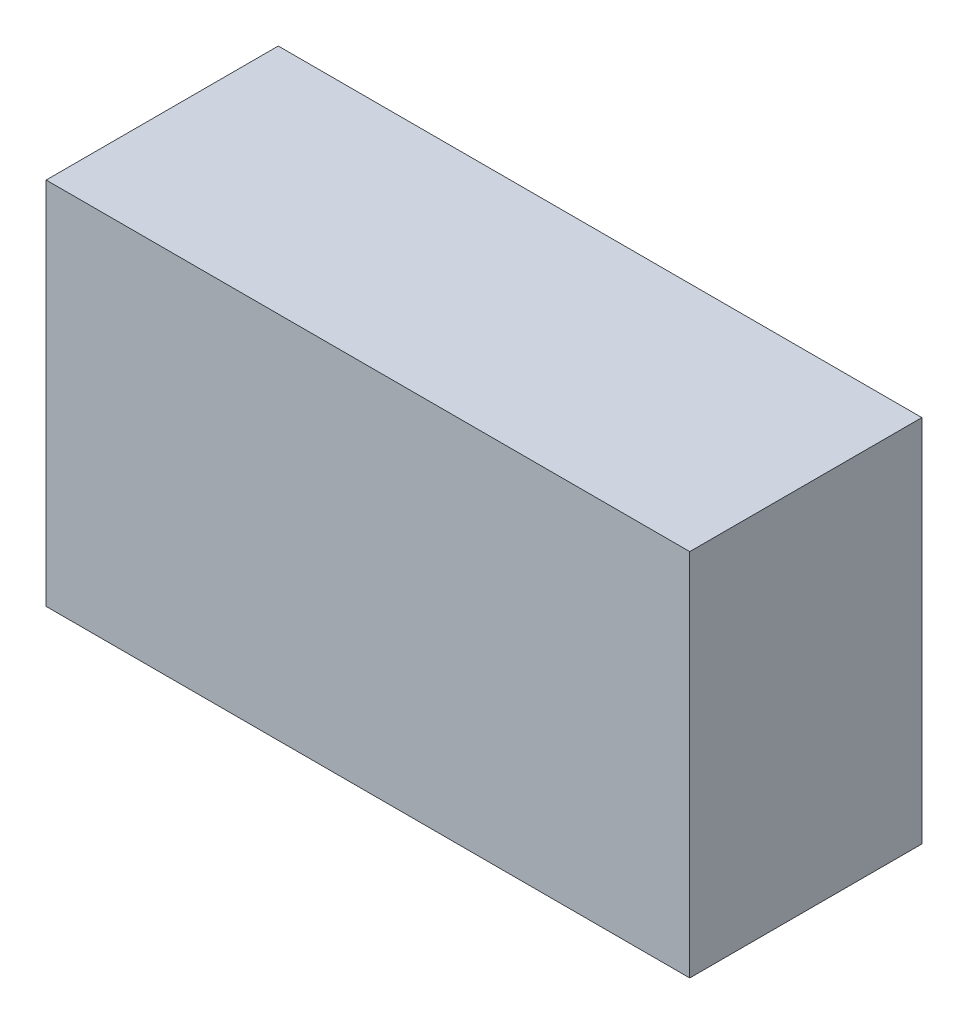
ISO-10303-21;
HEADER;
FILE_DESCRIPTION(('STEP AP214'),'2;1');
FILE_NAME('part.step','',(''),(''),'','','');
FILE_SCHEMA(('AUTOMOTIVE_DESIGN { 1 0 10303 214 1 1 1 1 }'));
ENDSEC;
DATA;
#1=APPLICATION_CONTEXT('core data for automotive mechanical design processes');
#2=APPLICATION_PROTOCOL_DEFINITION('international standard','automotive_design',2000,#1);
#3=PRODUCT_CONTEXT('',#1,'mechanical');
#4=PRODUCT('Part','Part','',(#3));
#5=PRODUCT_RELATED_PRODUCT_CATEGORY('part','',(#4));
#6=PRODUCT_DEFINITION_FORMATION('','',#4);
#7=PRODUCT_DEFINITION_CONTEXT('part definition',#1,'design');
#8=PRODUCT_DEFINITION('design','',#6,#7);
#9=PRODUCT_DEFINITION_SHAPE('','',#8);
#10=(LENGTH_UNIT() NAMED_UNIT(*) SI_UNIT(.MILLI.,.METRE.));
#11=(NAMED_UNIT(*) PLANE_ANGLE_UNIT() SI_UNIT($,.RADIAN.));
#12=(NAMED_UNIT(*) SI_UNIT($,.STERADIAN.) SOLID_ANGLE_UNIT());
#13=UNCERTAINTY_MEASURE_WITH_UNIT(LENGTH_MEASURE(1.E-05),#10,'distance_accuracy_value','');
#14=(GEOMETRIC_REPRESENTATION_CONTEXT(3) GLOBAL_UNCERTAINTY_ASSIGNED_CONTEXT((#13)) GLOBAL_UNIT_ASSIGNED_CONTEXT((#10,
#11,#12)) REPRESENTATION_CONTEXT('',''));
#15=CARTESIAN_POINT('',(0.,0.,0.));
#16=DIRECTION('',(0.,0.,1.));
#17=DIRECTION('',(1.,0.,0.));
#18=AXIS2_PLACEMENT_3D('',#15,#16,#17);
#19=CARTESIAN_POINT('',(1.52500076,-0.87499952,1.10000034));
#20=DIRECTION('',(0.,0.,1.));
#21=DIRECTION('',(1.,0.,0.));
#22=AXIS2_PLACEMENT_3D('',#19,#20,#21);
#23=PLANE('',#22);
#24=DIRECTION('',(0.,1.,0.));
#25=VECTOR('',#24,1.);
#26=CARTESIAN_POINT('',(-1.52499822,-0.87499952,1.10000034));
#27=LINE('',#26,#25);
#28=CARTESIAN_POINT('',(-1.52499822,-0.87499952,1.10000034));
#29=VERTEX_POINT('',#28);
#30=CARTESIAN_POINT('',(-1.52499822,0.87499952,1.10000034));
#31=VERTEX_POINT('',#30);
#32=EDGE_CURVE('E52',#29,#31,#27,.T.);
#33=ORIENTED_EDGE('',*,*,#32,.F.);
#34=DIRECTION('',(1.,0.,0.));
#35=VECTOR('',#34,1.);
#36=CARTESIAN_POINT('',(1.52500076,-0.87499952,1.10000034));
#37=LINE('',#36,#35);
#38=CARTESIAN_POINT('',(1.52500076,-0.87499952,1.10000034));
#39=VERTEX_POINT('',#38);
#40=EDGE_CURVE('E67',#39,#29,#37,.F.);
#41=ORIENTED_EDGE('',*,*,#40,.F.);
#42=DIRECTION('',(0.,1.,0.));
#43=VECTOR('',#42,1.);
#44=CARTESIAN_POINT('',(1.52500076,0.87499952,1.10000034));
#45=LINE('',#44,#43);
#46=CARTESIAN_POINT('',(1.52500076,0.87499952,1.10000034));
#47=VERTEX_POINT('',#46);
#48=EDGE_CURVE('E19',#47,#39,#45,.F.);
#49=ORIENTED_EDGE('',*,*,#48,.F.);
#50=DIRECTION('',(1.,0.,0.));
#51=VECTOR('',#50,1.);
#52=CARTESIAN_POINT('',(-1.52499822,0.87499952,1.10000034));
#53=LINE('',#52,#51);
#54=EDGE_CURVE('E57',#31,#47,#53,.T.);
#55=ORIENTED_EDGE('',*,*,#54,.F.);
#56=EDGE_LOOP('',(#33,#41,#49,#55));
#57=FACE_BOUND('',#56,.T.);
#58=ADVANCED_FACE('F16',(#57),#23,.T.);
#59=CARTESIAN_POINT('',(1.52500076,0.87499952,0.));
#60=DIRECTION('',(1.,0.,0.));
#61=DIRECTION('',(0.,0.,-1.));
#62=AXIS2_PLACEMENT_3D('',#59,#60,#61);
#63=PLANE('',#62);
#64=DIRECTION('',(0.,0.,-1.));
#65=VECTOR('',#64,1.);
#66=CARTESIAN_POINT('',(1.52500076,-0.87499952,0.));
#67=LINE('',#66,#65);
#68=CARTESIAN_POINT('',(1.52500076,-0.87499952,0.));
#69=VERTEX_POINT('',#68);
#70=EDGE_CURVE('E78',#69,#39,#67,.F.);
#71=ORIENTED_EDGE('',*,*,#70,.F.);
#72=DIRECTION('',(0.,1.,0.));
#73=VECTOR('',#72,1.);
#74=CARTESIAN_POINT('',(1.52500076,-0.87499952,0.));
#75=LINE('',#74,#73);
#76=CARTESIAN_POINT('',(1.52500076,0.87499952,0.));
#77=VERTEX_POINT('',#76);
#78=EDGE_CURVE('E73',#69,#77,#75,.T.);
#79=ORIENTED_EDGE('',*,*,#78,.T.);
#80=DIRECTION('',(0.,0.,1.));
#81=VECTOR('',#80,1.);
#82=CARTESIAN_POINT('',(1.52500076,0.87499952,0.));
#83=LINE('',#82,#81);
#84=EDGE_CURVE('E62',#47,#77,#83,.F.);
#85=ORIENTED_EDGE('',*,*,#84,.F.);
#86=ORIENTED_EDGE('',*,*,#48,.T.);
#87=EDGE_LOOP('',(#71,#79,#85,#86));
#88=FACE_BOUND('',#87,.T.);
#89=ADVANCED_FACE('F72',(#88),#63,.T.);
#90=CARTESIAN_POINT('',(-1.52499822,0.87499952,0.));
#91=DIRECTION('',(0.,1.,0.));
#92=DIRECTION('',(0.,0.,1.));
#93=AXIS2_PLACEMENT_3D('',#90,#91,#92);
#94=PLANE('',#93);
#95=ORIENTED_EDGE('',*,*,#84,.T.);
#96=DIRECTION('',(1.,0.,0.));
#97=VECTOR('',#96,1.);
#98=CARTESIAN_POINT('',(1.52500076,0.87499952,0.));
#99=LINE('',#98,#97);
#100=CARTESIAN_POINT('',(-1.52499822,0.87499952,0.));
#101=VERTEX_POINT('',#100);
#102=EDGE_CURVE('E83',#77,#101,#99,.F.);
#103=ORIENTED_EDGE('',*,*,#102,.T.);
#104=DIRECTION('',(0.,0.,1.));
#105=VECTOR('',#104,1.);
#106=CARTESIAN_POINT('',(-1.52499822,0.87499952,0.));
#107=LINE('',#106,#105);
#108=EDGE_CURVE('E64',#31,#101,#107,.F.);
#109=ORIENTED_EDGE('',*,*,#108,.F.);
#110=ORIENTED_EDGE('',*,*,#54,.T.);
#111=EDGE_LOOP('',(#95,#103,#109,#110));
#112=FACE_BOUND('',#111,.T.);
#113=ADVANCED_FACE('F59',(#112),#94,.T.);
#114=CARTESIAN_POINT('',(-1.52499822,-0.87499952,0.));
#115=DIRECTION('',(-1.,0.,0.));
#116=DIRECTION('',(0.,0.,1.));
#117=AXIS2_PLACEMENT_3D('',#114,#115,#116);
#118=PLANE('',#117);
#119=ORIENTED_EDGE('',*,*,#108,.T.);
#120=DIRECTION('',(0.,1.,0.));
#121=VECTOR('',#120,1.);
#122=CARTESIAN_POINT('',(-1.52499822,-0.87499952,0.));
#123=LINE('',#122,#121);
#124=CARTESIAN_POINT('',(-1.52499822,-0.87499952,0.));
#125=VERTEX_POINT('',#124);
#126=EDGE_CURVE('E25',#101,#125,#123,.F.);
#127=ORIENTED_EDGE('',*,*,#126,.T.);
#128=DIRECTION('',(0.,0.,-1.));
#129=VECTOR('',#128,1.);
#130=CARTESIAN_POINT('',(-1.52499822,-0.87499952,0.));
#131=LINE('',#130,#129);
#132=EDGE_CURVE('E33',#29,#125,#131,.T.);
#133=ORIENTED_EDGE('',*,*,#132,.F.);
#134=ORIENTED_EDGE('',*,*,#32,.T.);
#135=EDGE_LOOP('',(#119,#127,#133,#134));
#136=FACE_BOUND('',#135,.T.);
#137=ADVANCED_FACE('F87',(#136),#118,.T.);
#138=CARTESIAN_POINT('',(1.52500076,-0.87499952,0.));
#139=DIRECTION('',(0.,-1.,0.));
#140=DIRECTION('',(0.,0.,-1.));
#141=AXIS2_PLACEMENT_3D('',#138,#139,#140);
#142=PLANE('',#141);
#143=ORIENTED_EDGE('',*,*,#132,.T.);
#144=DIRECTION('',(1.,0.,0.));
#145=VECTOR('',#144,1.);
#146=CARTESIAN_POINT('',(1.52500076,-0.87499952,0.));
#147=LINE('',#146,#145);
#148=EDGE_CURVE('E11',#125,#69,#147,.T.);
#149=ORIENTED_EDGE('',*,*,#148,.T.);
#150=ORIENTED_EDGE('',*,*,#70,.T.);
#151=ORIENTED_EDGE('',*,*,#40,.T.);
#152=EDGE_LOOP('',(#143,#149,#150,#151));
#153=FACE_BOUND('',#152,.T.);
#154=ADVANCED_FACE('F90',(#153),#142,.T.);
#155=CARTESIAN_POINT('',(1.52500076,-0.87499952,0.));
#156=DIRECTION('',(0.,0.,1.));
#157=DIRECTION('',(1.,0.,0.));
#158=AXIS2_PLACEMENT_3D('',#155,#156,#157);
#159=PLANE('',#158);
#160=ORIENTED_EDGE('',*,*,#126,.F.);
#161=ORIENTED_EDGE('',*,*,#102,.F.);
#162=ORIENTED_EDGE('',*,*,#78,.F.);
#163=ORIENTED_EDGE('',*,*,#148,.F.);
#164=EDGE_LOOP('',(#160,#161,#162,#163));
#165=FACE_BOUND('',#164,.T.);
#166=ADVANCED_FACE('F89',(#165),#159,.F.);
#167=CLOSED_SHELL('',(#58,#89,#113,#137,#154,#166));
#168=MANIFOLD_SOLID_BREP('B1',#167);
#169=ADVANCED_BREP_SHAPE_REPRESENTATION('',(#18,#168),#14);
#170=SHAPE_DEFINITION_REPRESENTATION(#9,#169);
ENDSEC;
END-ISO-10303-21;
